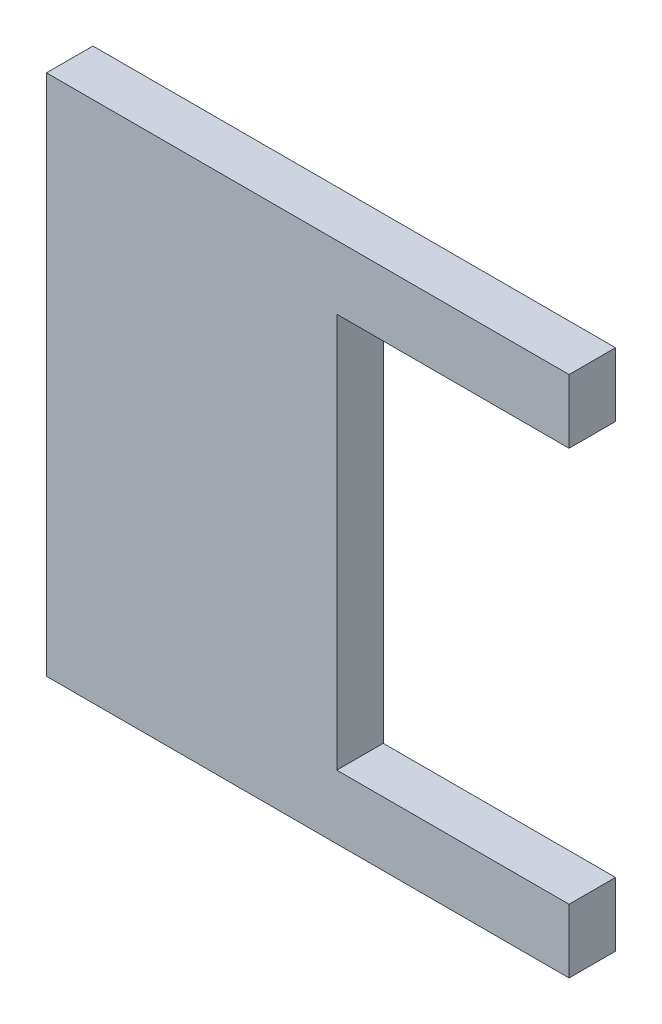
ISO-10303-21;
HEADER;
FILE_DESCRIPTION(('STEP AP214'),'2;1');
FILE_NAME('part.step','',(''),(''),'','','');
FILE_SCHEMA(('AUTOMOTIVE_DESIGN { 1 0 10303 214 1 1 1 1 }'));
ENDSEC;
DATA;
#1=APPLICATION_CONTEXT('core data for automotive mechanical design processes');
#2=APPLICATION_PROTOCOL_DEFINITION('international standard','automotive_design',2000,#1);
#3=PRODUCT_CONTEXT('',#1,'mechanical');
#4=PRODUCT('Part','Part','',(#3));
#5=PRODUCT_RELATED_PRODUCT_CATEGORY('part','',(#4));
#6=PRODUCT_DEFINITION_FORMATION('','',#4);
#7=PRODUCT_DEFINITION_CONTEXT('part definition',#1,'design');
#8=PRODUCT_DEFINITION('design','',#6,#7);
#9=PRODUCT_DEFINITION_SHAPE('','',#8);
#10=(LENGTH_UNIT() NAMED_UNIT(*) SI_UNIT(.MILLI.,.METRE.));
#11=(NAMED_UNIT(*) PLANE_ANGLE_UNIT() SI_UNIT($,.RADIAN.));
#12=(NAMED_UNIT(*) SI_UNIT($,.STERADIAN.) SOLID_ANGLE_UNIT());
#13=UNCERTAINTY_MEASURE_WITH_UNIT(LENGTH_MEASURE(1.E-05),#10,'distance_accuracy_value','');
#14=(GEOMETRIC_REPRESENTATION_CONTEXT(3) GLOBAL_UNCERTAINTY_ASSIGNED_CONTEXT((#13)) GLOBAL_UNIT_ASSIGNED_CONTEXT((#10,
#11,#12)) REPRESENTATION_CONTEXT('',''));
#15=CARTESIAN_POINT('',(0.,0.,0.));
#16=DIRECTION('',(0.,0.,1.));
#17=DIRECTION('',(1.,0.,0.));
#18=AXIS2_PLACEMENT_3D('',#15,#16,#17);
#19=CARTESIAN_POINT('',(90.,0.,8.));
#20=DIRECTION('',(0.,1.,0.));
#21=DIRECTION('',(-1.,0.,0.));
#22=AXIS2_PLACEMENT_3D('',#19,#20,#21);
#23=PLANE('',#22);
#24=DIRECTION('',(1.,0.,0.));
#25=VECTOR('',#24,1.);
#26=CARTESIAN_POINT('',(90.,0.,0.));
#27=LINE('',#26,#25);
#28=CARTESIAN_POINT('',(0.,0.,0.));
#29=VERTEX_POINT('',#28);
#30=CARTESIAN_POINT('',(90.,0.,0.));
#31=VERTEX_POINT('',#30);
#32=EDGE_CURVE('E129',#29,#31,#27,.T.);
#33=ORIENTED_EDGE('',*,*,#32,.T.);
#34=DIRECTION('',(0.,0.,-1.));
#35=VECTOR('',#34,1.);
#36=CARTESIAN_POINT('',(90.,0.,8.));
#37=LINE('',#36,#35);
#38=CARTESIAN_POINT('',(90.,0.,8.));
#39=VERTEX_POINT('',#38);
#40=EDGE_CURVE('E11',#39,#31,#37,.T.);
#41=ORIENTED_EDGE('',*,*,#40,.F.);
#42=DIRECTION('',(1.,0.,0.));
#43=VECTOR('',#42,1.);
#44=CARTESIAN_POINT('',(90.,0.,8.));
#45=LINE('',#44,#43);
#46=CARTESIAN_POINT('',(0.,0.,8.));
#47=VERTEX_POINT('',#46);
#48=EDGE_CURVE('E143',#47,#39,#45,.T.);
#49=ORIENTED_EDGE('',*,*,#48,.F.);
#50=DIRECTION('',(0.,0.,-1.));
#51=VECTOR('',#50,1.);
#52=CARTESIAN_POINT('',(0.,0.,8.));
#53=LINE('',#52,#51);
#54=EDGE_CURVE('E125',#47,#29,#53,.T.);
#55=ORIENTED_EDGE('',*,*,#54,.T.);
#56=EDGE_LOOP('',(#33,#41,#49,#55));
#57=FACE_BOUND('',#56,.T.);
#58=ADVANCED_FACE('F33',(#57),#23,.F.);
#59=CARTESIAN_POINT('',(90.,11.,8.));
#60=DIRECTION('',(-1.,0.,0.));
#61=DIRECTION('',(0.,0.,1.));
#62=AXIS2_PLACEMENT_3D('',#59,#60,#61);
#63=PLANE('',#62);
#64=DIRECTION('',(0.,1.,0.));
#65=VECTOR('',#64,1.);
#66=CARTESIAN_POINT('',(90.,11.,0.));
#67=LINE('',#66,#65);
#68=CARTESIAN_POINT('',(90.,11.,0.));
#69=VERTEX_POINT('',#68);
#70=EDGE_CURVE('E132',#31,#69,#67,.T.);
#71=ORIENTED_EDGE('',*,*,#70,.T.);
#72=DIRECTION('',(0.,0.,-1.));
#73=VECTOR('',#72,1.);
#74=CARTESIAN_POINT('',(90.,11.,8.));
#75=LINE('',#74,#73);
#76=CARTESIAN_POINT('',(90.,11.,8.));
#77=VERTEX_POINT('',#76);
#78=EDGE_CURVE('E41',#77,#69,#75,.T.);
#79=ORIENTED_EDGE('',*,*,#78,.F.);
#80=DIRECTION('',(0.,1.,0.));
#81=VECTOR('',#80,1.);
#82=CARTESIAN_POINT('',(90.,11.,8.));
#83=LINE('',#82,#81);
#84=EDGE_CURVE('E92',#39,#77,#83,.T.);
#85=ORIENTED_EDGE('',*,*,#84,.F.);
#86=ORIENTED_EDGE('',*,*,#40,.T.);
#87=EDGE_LOOP('',(#71,#79,#85,#86));
#88=FACE_BOUND('',#87,.T.);
#89=ADVANCED_FACE('F178',(#88),#63,.F.);
#90=CARTESIAN_POINT('',(50.,11.,8.));
#91=DIRECTION('',(0.,-1.,0.));
#92=DIRECTION('',(0.,0.,-1.));
#93=AXIS2_PLACEMENT_3D('',#90,#91,#92);
#94=PLANE('',#93);
#95=DIRECTION('',(-1.,0.,0.));
#96=VECTOR('',#95,1.);
#97=CARTESIAN_POINT('',(50.,11.,0.));
#98=LINE('',#97,#96);
#99=CARTESIAN_POINT('',(50.,11.,0.));
#100=VERTEX_POINT('',#99);
#101=EDGE_CURVE('E134',#69,#100,#98,.T.);
#102=ORIENTED_EDGE('',*,*,#101,.T.);
#103=DIRECTION('',(0.,0.,-1.));
#104=VECTOR('',#103,1.);
#105=CARTESIAN_POINT('',(50.,11.,8.));
#106=LINE('',#105,#104);
#107=CARTESIAN_POINT('',(50.,11.,8.));
#108=VERTEX_POINT('',#107);
#109=EDGE_CURVE('E150',#108,#100,#106,.T.);
#110=ORIENTED_EDGE('',*,*,#109,.F.);
#111=DIRECTION('',(-1.,0.,0.));
#112=VECTOR('',#111,1.);
#113=CARTESIAN_POINT('',(50.,11.,8.));
#114=LINE('',#113,#112);
#115=EDGE_CURVE('E158',#77,#108,#114,.T.);
#116=ORIENTED_EDGE('',*,*,#115,.F.);
#117=ORIENTED_EDGE('',*,*,#78,.T.);
#118=EDGE_LOOP('',(#102,#110,#116,#117));
#119=FACE_BOUND('',#118,.T.);
#120=ADVANCED_FACE('F156',(#119),#94,.F.);
#121=CARTESIAN_POINT('',(50.,79.,8.));
#122=DIRECTION('',(-1.,0.,0.));
#123=DIRECTION('',(0.,-1.,0.));
#124=AXIS2_PLACEMENT_3D('',#121,#122,#123);
#125=PLANE('',#124);
#126=DIRECTION('',(0.,1.,0.));
#127=VECTOR('',#126,1.);
#128=CARTESIAN_POINT('',(50.,79.,0.));
#129=LINE('',#128,#127);
#130=CARTESIAN_POINT('',(50.,79.,0.));
#131=VERTEX_POINT('',#130);
#132=EDGE_CURVE('E136',#100,#131,#129,.T.);
#133=ORIENTED_EDGE('',*,*,#132,.T.);
#134=DIRECTION('',(0.,0.,-1.));
#135=VECTOR('',#134,1.);
#136=CARTESIAN_POINT('',(50.,79.,8.));
#137=LINE('',#136,#135);
#138=CARTESIAN_POINT('',(50.,79.,8.));
#139=VERTEX_POINT('',#138);
#140=EDGE_CURVE('E147',#139,#131,#137,.T.);
#141=ORIENTED_EDGE('',*,*,#140,.F.);
#142=DIRECTION('',(0.,1.,0.));
#143=VECTOR('',#142,1.);
#144=CARTESIAN_POINT('',(50.,79.,8.));
#145=LINE('',#144,#143);
#146=EDGE_CURVE('E170',#108,#139,#145,.T.);
#147=ORIENTED_EDGE('',*,*,#146,.F.);
#148=ORIENTED_EDGE('',*,*,#109,.T.);
#149=EDGE_LOOP('',(#133,#141,#147,#148));
#150=FACE_BOUND('',#149,.T.);
#151=ADVANCED_FACE('F166',(#150),#125,.F.);
#152=CARTESIAN_POINT('',(90.,79.,8.));
#153=DIRECTION('',(0.,1.,0.));
#154=DIRECTION('',(0.,0.,1.));
#155=AXIS2_PLACEMENT_3D('',#152,#153,#154);
#156=PLANE('',#155);
#157=DIRECTION('',(1.,0.,0.));
#158=VECTOR('',#157,1.);
#159=CARTESIAN_POINT('',(90.,79.,0.));
#160=LINE('',#159,#158);
#161=CARTESIAN_POINT('',(90.,79.,0.));
#162=VERTEX_POINT('',#161);
#163=EDGE_CURVE('E138',#131,#162,#160,.T.);
#164=ORIENTED_EDGE('',*,*,#163,.T.);
#165=DIRECTION('',(0.,0.,-1.));
#166=VECTOR('',#165,1.);
#167=CARTESIAN_POINT('',(90.,79.,8.));
#168=LINE('',#167,#166);
#169=CARTESIAN_POINT('',(90.,79.,8.));
#170=VERTEX_POINT('',#169);
#171=EDGE_CURVE('E120',#170,#162,#168,.T.);
#172=ORIENTED_EDGE('',*,*,#171,.F.);
#173=DIRECTION('',(1.,0.,0.));
#174=VECTOR('',#173,1.);
#175=CARTESIAN_POINT('',(90.,79.,8.));
#176=LINE('',#175,#174);
#177=EDGE_CURVE('E111',#139,#170,#176,.T.);
#178=ORIENTED_EDGE('',*,*,#177,.F.);
#179=ORIENTED_EDGE('',*,*,#140,.T.);
#180=EDGE_LOOP('',(#164,#172,#178,#179));
#181=FACE_BOUND('',#180,.T.);
#182=ADVANCED_FACE('F169',(#181),#156,.F.);
#183=CARTESIAN_POINT('',(90.,90.,8.));
#184=DIRECTION('',(-1.,0.,0.));
#185=DIRECTION('',(0.,0.,1.));
#186=AXIS2_PLACEMENT_3D('',#183,#184,#185);
#187=PLANE('',#186);
#188=DIRECTION('',(0.,1.,0.));
#189=VECTOR('',#188,1.);
#190=CARTESIAN_POINT('',(90.,90.,0.));
#191=LINE('',#190,#189);
#192=CARTESIAN_POINT('',(90.,90.,0.));
#193=VERTEX_POINT('',#192);
#194=EDGE_CURVE('E119',#162,#193,#191,.T.);
#195=ORIENTED_EDGE('',*,*,#194,.T.);
#196=DIRECTION('',(0.,0.,-1.));
#197=VECTOR('',#196,1.);
#198=CARTESIAN_POINT('',(90.,90.,8.));
#199=LINE('',#198,#197);
#200=CARTESIAN_POINT('',(90.,90.,8.));
#201=VERTEX_POINT('',#200);
#202=EDGE_CURVE('E116',#201,#193,#199,.T.);
#203=ORIENTED_EDGE('',*,*,#202,.F.);
#204=DIRECTION('',(0.,1.,0.));
#205=VECTOR('',#204,1.);
#206=CARTESIAN_POINT('',(90.,90.,8.));
#207=LINE('',#206,#205);
#208=EDGE_CURVE('E105',#170,#201,#207,.T.);
#209=ORIENTED_EDGE('',*,*,#208,.F.);
#210=ORIENTED_EDGE('',*,*,#171,.T.);
#211=EDGE_LOOP('',(#195,#203,#209,#210));
#212=FACE_BOUND('',#211,.T.);
#213=ADVANCED_FACE('F117',(#212),#187,.F.);
#214=CARTESIAN_POINT('',(0.,90.,8.));
#215=DIRECTION('',(0.,-1.,0.));
#216=DIRECTION('',(0.,0.,-1.));
#217=AXIS2_PLACEMENT_3D('',#214,#215,#216);
#218=PLANE('',#217);
#219=DIRECTION('',(-1.,0.,0.));
#220=VECTOR('',#219,1.);
#221=CARTESIAN_POINT('',(0.,90.,0.));
#222=LINE('',#221,#220);
#223=CARTESIAN_POINT('',(0.,90.,0.));
#224=VERTEX_POINT('',#223);
#225=EDGE_CURVE('E78',#193,#224,#222,.T.);
#226=ORIENTED_EDGE('',*,*,#225,.T.);
#227=DIRECTION('',(0.,0.,-1.));
#228=VECTOR('',#227,1.);
#229=CARTESIAN_POINT('',(0.,90.,8.));
#230=LINE('',#229,#228);
#231=CARTESIAN_POINT('',(0.,90.,8.));
#232=VERTEX_POINT('',#231);
#233=EDGE_CURVE('E121',#232,#224,#230,.T.);
#234=ORIENTED_EDGE('',*,*,#233,.F.);
#235=DIRECTION('',(-1.,0.,0.));
#236=VECTOR('',#235,1.);
#237=CARTESIAN_POINT('',(0.,90.,8.));
#238=LINE('',#237,#236);
#239=EDGE_CURVE('E109',#201,#232,#238,.T.);
#240=ORIENTED_EDGE('',*,*,#239,.F.);
#241=ORIENTED_EDGE('',*,*,#202,.T.);
#242=EDGE_LOOP('',(#226,#234,#240,#241));
#243=FACE_BOUND('',#242,.T.);
#244=ADVANCED_FACE('F123',(#243),#218,.F.);
#245=CARTESIAN_POINT('',(0.,0.,8.));
#246=DIRECTION('',(1.,0.,0.));
#247=DIRECTION('',(0.,0.,-1.));
#248=AXIS2_PLACEMENT_3D('',#245,#246,#247);
#249=PLANE('',#248);
#250=DIRECTION('',(0.,-1.,0.));
#251=VECTOR('',#250,1.);
#252=CARTESIAN_POINT('',(0.,0.,0.));
#253=LINE('',#252,#251);
#254=EDGE_CURVE('E84',#224,#29,#253,.T.);
#255=ORIENTED_EDGE('',*,*,#254,.T.);
#256=ORIENTED_EDGE('',*,*,#54,.F.);
#257=DIRECTION('',(0.,-1.,0.));
#258=VECTOR('',#257,1.);
#259=CARTESIAN_POINT('',(0.,0.,8.));
#260=LINE('',#259,#258);
#261=EDGE_CURVE('E49',#232,#47,#260,.T.);
#262=ORIENTED_EDGE('',*,*,#261,.F.);
#263=ORIENTED_EDGE('',*,*,#233,.T.);
#264=EDGE_LOOP('',(#255,#256,#262,#263));
#265=FACE_BOUND('',#264,.T.);
#266=ADVANCED_FACE('F194',(#265),#249,.F.);
#267=CARTESIAN_POINT('',(0.,0.,8.));
#268=DIRECTION('',(0.,0.,-1.));
#269=DIRECTION('',(-1.,0.,0.));
#270=AXIS2_PLACEMENT_3D('',#267,#268,#269);
#271=PLANE('',#270);
#272=ORIENTED_EDGE('',*,*,#48,.T.);
#273=ORIENTED_EDGE('',*,*,#84,.T.);
#274=ORIENTED_EDGE('',*,*,#115,.T.);
#275=ORIENTED_EDGE('',*,*,#146,.T.);
#276=ORIENTED_EDGE('',*,*,#177,.T.);
#277=ORIENTED_EDGE('',*,*,#208,.T.);
#278=ORIENTED_EDGE('',*,*,#239,.T.);
#279=ORIENTED_EDGE('',*,*,#261,.T.);
#280=EDGE_LOOP('',(#272,#273,#274,#275,#276,#277,#278,#279));
#281=FACE_BOUND('',#280,.T.);
#282=ADVANCED_FACE('F107',(#281),#271,.F.);
#283=CARTESIAN_POINT('',(0.,0.,0.));
#284=DIRECTION('',(0.,0.,-1.));
#285=DIRECTION('',(-1.,0.,0.));
#286=AXIS2_PLACEMENT_3D('',#283,#284,#285);
#287=PLANE('',#286);
#288=ORIENTED_EDGE('',*,*,#32,.F.);
#289=ORIENTED_EDGE('',*,*,#254,.F.);
#290=ORIENTED_EDGE('',*,*,#225,.F.);
#291=ORIENTED_EDGE('',*,*,#194,.F.);
#292=ORIENTED_EDGE('',*,*,#163,.F.);
#293=ORIENTED_EDGE('',*,*,#132,.F.);
#294=ORIENTED_EDGE('',*,*,#101,.F.);
#295=ORIENTED_EDGE('',*,*,#70,.F.);
#296=EDGE_LOOP('',(#288,#289,#290,#291,#292,#293,#294,#295));
#297=FACE_BOUND('',#296,.T.);
#298=ADVANCED_FACE('F162',(#297),#287,.T.);
#299=CLOSED_SHELL('',(#58,#89,#120,#151,#182,#213,#244,#266,#282,#298));
#300=MANIFOLD_SOLID_BREP('B2',#299);
#301=ADVANCED_BREP_SHAPE_REPRESENTATION('',(#18,#300),#14);
#302=SHAPE_DEFINITION_REPRESENTATION(#9,#301);
ENDSEC;
END-ISO-10303-21;
